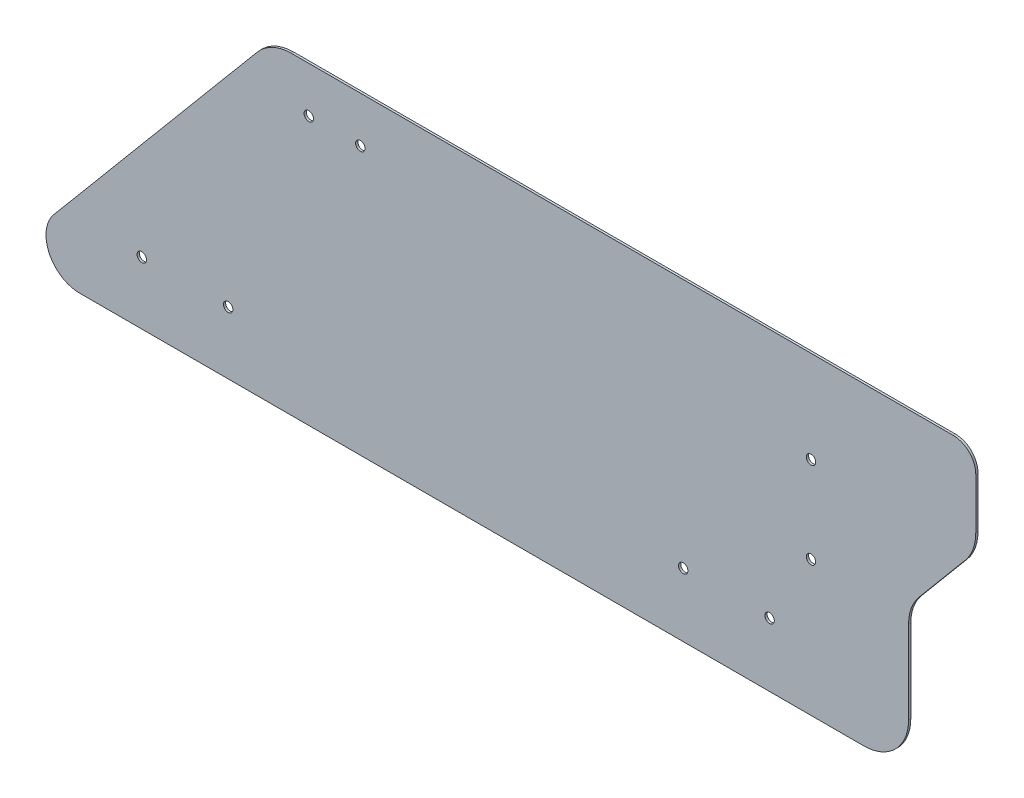
ISO-10303-21;
HEADER;
FILE_DESCRIPTION(('STEP AP214'),'2;1');
FILE_NAME('part.step','',(''),(''),'','','');
FILE_SCHEMA(('AUTOMOTIVE_DESIGN { 1 0 10303 214 1 1 1 1 }'));
ENDSEC;
DATA;
#1=APPLICATION_CONTEXT('core data for automotive mechanical design processes');
#2=APPLICATION_PROTOCOL_DEFINITION('international standard','automotive_design',2000,#1);
#3=PRODUCT_CONTEXT('',#1,'mechanical');
#4=PRODUCT('Part','Part','',(#3));
#5=PRODUCT_RELATED_PRODUCT_CATEGORY('part','',(#4));
#6=PRODUCT_DEFINITION_FORMATION('','',#4);
#7=PRODUCT_DEFINITION_CONTEXT('part definition',#1,'design');
#8=PRODUCT_DEFINITION('design','',#6,#7);
#9=PRODUCT_DEFINITION_SHAPE('','',#8);
#10=(LENGTH_UNIT() NAMED_UNIT(*) SI_UNIT(.MILLI.,.METRE.));
#11=(NAMED_UNIT(*) PLANE_ANGLE_UNIT() SI_UNIT($,.RADIAN.));
#12=(NAMED_UNIT(*) SI_UNIT($,.STERADIAN.) SOLID_ANGLE_UNIT());
#13=UNCERTAINTY_MEASURE_WITH_UNIT(LENGTH_MEASURE(1.E-05),#10,'distance_accuracy_value','');
#14=(GEOMETRIC_REPRESENTATION_CONTEXT(3) GLOBAL_UNCERTAINTY_ASSIGNED_CONTEXT((#13)) GLOBAL_UNIT_ASSIGNED_CONTEXT((#10,
#11,#12)) REPRESENTATION_CONTEXT('',''));
#15=CARTESIAN_POINT('',(0.,0.,0.));
#16=DIRECTION('',(0.,0.,1.));
#17=DIRECTION('',(1.,0.,0.));
#18=AXIS2_PLACEMENT_3D('',#15,#16,#17);
#19=CARTESIAN_POINT('',(190.,60.,-1.));
#20=DIRECTION('',(0.,0.,1.));
#21=DIRECTION('',(1.,0.,0.));
#22=AXIS2_PLACEMENT_3D('',#19,#20,#21);
#23=CYLINDRICAL_SURFACE('',#22,10.);
#24=CARTESIAN_POINT('',(190.,60.,0.));
#25=DIRECTION('',(0.,0.,1.));
#26=DIRECTION('',(-1.,0.,0.));
#27=AXIS2_PLACEMENT_3D('',#24,#25,#26);
#28=CIRCLE('',#27,10.);
#29=CARTESIAN_POINT('',(200.,60.,0.));
#30=VERTEX_POINT('',#29);
#31=CARTESIAN_POINT('',(190.,70.,0.));
#32=VERTEX_POINT('',#31);
#33=EDGE_CURVE('E160',#30,#32,#28,.T.);
#34=ORIENTED_EDGE('',*,*,#33,.F.);
#35=DIRECTION('',(0.,0.,1.));
#36=VECTOR('',#35,1.);
#37=CARTESIAN_POINT('',(200.,60.,-1.));
#38=LINE('',#37,#36);
#39=CARTESIAN_POINT('',(200.,60.,-1.));
#40=VERTEX_POINT('',#39);
#41=EDGE_CURVE('E11',#40,#30,#38,.T.);
#42=ORIENTED_EDGE('',*,*,#41,.F.);
#43=CARTESIAN_POINT('',(190.,60.,-1.));
#44=DIRECTION('',(0.,0.,1.));
#45=DIRECTION('',(-1.,0.,0.));
#46=AXIS2_PLACEMENT_3D('',#43,#44,#45);
#47=CIRCLE('',#46,10.);
#48=CARTESIAN_POINT('',(190.,70.,-1.));
#49=VERTEX_POINT('',#48);
#50=EDGE_CURVE('E193',#40,#49,#47,.T.);
#51=ORIENTED_EDGE('',*,*,#50,.T.);
#52=DIRECTION('',(0.,0.,1.));
#53=VECTOR('',#52,1.);
#54=CARTESIAN_POINT('',(190.,70.,-1.));
#55=LINE('',#54,#53);
#56=EDGE_CURVE('E106',#49,#32,#55,.T.);
#57=ORIENTED_EDGE('',*,*,#56,.T.);
#58=EDGE_LOOP('',(#34,#42,#51,#57));
#59=FACE_BOUND('',#58,.T.);
#60=ADVANCED_FACE('F38',(#59),#23,.T.);
#61=CARTESIAN_POINT('',(200.,37.2794046853241,-1.));
#62=DIRECTION('',(1.,0.,0.));
#63=DIRECTION('',(0.,1.,0.));
#64=AXIS2_PLACEMENT_3D('',#61,#62,#63);
#65=PLANE('',#64);
#66=DIRECTION('',(0.,1.,0.));
#67=VECTOR('',#66,1.);
#68=CARTESIAN_POINT('',(200.,37.2794046853241,0.));
#69=LINE('',#68,#67);
#70=CARTESIAN_POINT('',(200.,37.2794046853241,0.));
#71=VERTEX_POINT('',#70);
#72=EDGE_CURVE('E191',#71,#30,#69,.T.);
#73=ORIENTED_EDGE('',*,*,#72,.F.);
#74=DIRECTION('',(0.,0.,1.));
#75=VECTOR('',#74,1.);
#76=CARTESIAN_POINT('',(200.,37.2794046853241,-1.));
#77=LINE('',#76,#75);
#78=CARTESIAN_POINT('',(200.,37.2794046853241,-1.));
#79=VERTEX_POINT('',#78);
#80=EDGE_CURVE('E47',#79,#71,#77,.T.);
#81=ORIENTED_EDGE('',*,*,#80,.F.);
#82=DIRECTION('',(0.,1.,0.));
#83=VECTOR('',#82,1.);
#84=CARTESIAN_POINT('',(200.,37.2794046853241,-1.));
#85=LINE('',#84,#83);
#86=EDGE_CURVE('E150',#79,#40,#85,.T.);
#87=ORIENTED_EDGE('',*,*,#86,.T.);
#88=ORIENTED_EDGE('',*,*,#41,.T.);
#89=EDGE_LOOP('',(#73,#81,#87,#88));
#90=FACE_BOUND('',#89,.T.);
#91=ADVANCED_FACE('F301',(#90),#65,.T.);
#92=CARTESIAN_POINT('',(180.,37.2794046853241,-1.));
#93=DIRECTION('',(0.,0.,1.));
#94=DIRECTION('',(1.,0.,0.));
#95=AXIS2_PLACEMENT_3D('',#92,#93,#94);
#96=CYLINDRICAL_SURFACE('',#95,20.);
#97=CARTESIAN_POINT('',(180.,37.2794046853241,0.));
#98=DIRECTION('',(0.,0.,1.));
#99=DIRECTION('',(1.,0.,0.));
#100=AXIS2_PLACEMENT_3D('',#97,#98,#99);
#101=CIRCLE('',#100,20.);
#102=CARTESIAN_POINT('',(195.320888862379,24.4236524915933,0.));
#103=VERTEX_POINT('',#102);
#104=EDGE_CURVE('E137',#103,#71,#101,.T.);
#105=ORIENTED_EDGE('',*,*,#104,.F.);
#106=DIRECTION('',(0.,0.,1.));
#107=VECTOR('',#106,1.);
#108=CARTESIAN_POINT('',(195.320888862379,24.4236524915933,-1.));
#109=LINE('',#108,#107);
#110=CARTESIAN_POINT('',(195.320888862379,24.4236524915933,-1.));
#111=VERTEX_POINT('',#110);
#112=EDGE_CURVE('E132',#111,#103,#109,.T.);
#113=ORIENTED_EDGE('',*,*,#112,.F.);
#114=CARTESIAN_POINT('',(180.,37.2794046853241,-1.));
#115=DIRECTION('',(0.,0.,1.));
#116=DIRECTION('',(1.,0.,0.));
#117=AXIS2_PLACEMENT_3D('',#114,#115,#116);
#118=CIRCLE('',#117,20.);
#119=EDGE_CURVE('E135',#111,#79,#118,.T.);
#120=ORIENTED_EDGE('',*,*,#119,.T.);
#121=ORIENTED_EDGE('',*,*,#80,.T.);
#122=EDGE_LOOP('',(#105,#113,#120,#121));
#123=FACE_BOUND('',#122,.T.);
#124=ADVANCED_FACE('F134',(#123),#96,.T.);
#125=CARTESIAN_POINT('',(174.67911113762,-0.176260269419207,-1.));
#126=DIRECTION('',(0.766044443118975,-0.642787609686543,0.));
#127=DIRECTION('',(0.642787609686543,0.766044443118975,0.));
#128=AXIS2_PLACEMENT_3D('',#125,#126,#127);
#129=PLANE('',#128);
#130=DIRECTION('',(0.642787609686543,0.766044443118975,0.));
#131=VECTOR('',#130,1.);
#132=CARTESIAN_POINT('',(174.67911113762,-0.176260269419207,0.));
#133=LINE('',#132,#131);
#134=CARTESIAN_POINT('',(174.67911113762,-0.176260269419217,0.));
#135=VERTEX_POINT('',#134);
#136=EDGE_CURVE('E188',#135,#103,#133,.T.);
#137=ORIENTED_EDGE('',*,*,#136,.F.);
#138=DIRECTION('',(0.,0.,1.));
#139=VECTOR('',#138,1.);
#140=CARTESIAN_POINT('',(174.67911113762,-0.176260269419217,-1.));
#141=LINE('',#140,#139);
#142=CARTESIAN_POINT('',(174.67911113762,-0.176260269419217,-1.));
#143=VERTEX_POINT('',#142);
#144=EDGE_CURVE('E142',#143,#135,#141,.T.);
#145=ORIENTED_EDGE('',*,*,#144,.F.);
#146=DIRECTION('',(0.642787609686543,0.766044443118975,0.));
#147=VECTOR('',#146,1.);
#148=CARTESIAN_POINT('',(174.67911113762,-0.176260269419207,-1.));
#149=LINE('',#148,#147);
#150=EDGE_CURVE('E148',#143,#111,#149,.T.);
#151=ORIENTED_EDGE('',*,*,#150,.T.);
#152=ORIENTED_EDGE('',*,*,#112,.T.);
#153=EDGE_LOOP('',(#137,#145,#151,#152));
#154=FACE_BOUND('',#153,.T.);
#155=ADVANCED_FACE('F152',(#154),#129,.T.);
#156=CARTESIAN_POINT('',(190.,-13.0320124631501,-1.));
#157=DIRECTION('',(0.,0.,1.));
#158=DIRECTION('',(1.,0.,0.));
#159=AXIS2_PLACEMENT_3D('',#156,#157,#158);
#160=CYLINDRICAL_SURFACE('',#159,20.);
#161=CARTESIAN_POINT('',(190.,-13.0320124631501,0.));
#162=DIRECTION('',(0.,0.,-1.));
#163=DIRECTION('',(-1.,0.,0.));
#164=AXIS2_PLACEMENT_3D('',#161,#162,#163);
#165=CIRCLE('',#164,20.);
#166=CARTESIAN_POINT('',(170.,-13.0320124631501,0.));
#167=VERTEX_POINT('',#166);
#168=EDGE_CURVE('E185',#167,#135,#165,.T.);
#169=ORIENTED_EDGE('',*,*,#168,.F.);
#170=DIRECTION('',(0.,0.,1.));
#171=VECTOR('',#170,1.);
#172=CARTESIAN_POINT('',(170.,-13.0320124631501,-1.));
#173=LINE('',#172,#171);
#174=CARTESIAN_POINT('',(170.,-13.0320124631501,-1.));
#175=VERTEX_POINT('',#174);
#176=EDGE_CURVE('E197',#175,#167,#173,.T.);
#177=ORIENTED_EDGE('',*,*,#176,.F.);
#178=CARTESIAN_POINT('',(190.,-13.0320124631501,-1.));
#179=DIRECTION('',(0.,0.,-1.));
#180=DIRECTION('',(-1.,0.,0.));
#181=AXIS2_PLACEMENT_3D('',#178,#179,#180);
#182=CIRCLE('',#181,20.);
#183=EDGE_CURVE('E153',#175,#143,#182,.T.);
#184=ORIENTED_EDGE('',*,*,#183,.T.);
#185=ORIENTED_EDGE('',*,*,#144,.T.);
#186=EDGE_LOOP('',(#169,#177,#184,#185));
#187=FACE_BOUND('',#186,.T.);
#188=ADVANCED_FACE('F314',(#187),#160,.F.);
#189=CARTESIAN_POINT('',(170.,-50.,-1.));
#190=DIRECTION('',(1.,0.,0.));
#191=DIRECTION('',(0.,1.,0.));
#192=AXIS2_PLACEMENT_3D('',#189,#190,#191);
#193=PLANE('',#192);
#194=DIRECTION('',(0.,1.,0.));
#195=VECTOR('',#194,1.);
#196=CARTESIAN_POINT('',(170.,-50.,0.));
#197=LINE('',#196,#195);
#198=CARTESIAN_POINT('',(170.,-50.,0.));
#199=VERTEX_POINT('',#198);
#200=EDGE_CURVE('E182',#199,#167,#197,.T.);
#201=ORIENTED_EDGE('',*,*,#200,.F.);
#202=DIRECTION('',(0.,0.,1.));
#203=VECTOR('',#202,1.);
#204=CARTESIAN_POINT('',(170.,-50.,-1.));
#205=LINE('',#204,#203);
#206=CARTESIAN_POINT('',(170.,-50.,-1.));
#207=VERTEX_POINT('',#206);
#208=EDGE_CURVE('E199',#207,#199,#205,.T.);
#209=ORIENTED_EDGE('',*,*,#208,.F.);
#210=DIRECTION('',(0.,1.,0.));
#211=VECTOR('',#210,1.);
#212=CARTESIAN_POINT('',(170.,-50.,-1.));
#213=LINE('',#212,#211);
#214=EDGE_CURVE('E155',#207,#175,#213,.T.);
#215=ORIENTED_EDGE('',*,*,#214,.T.);
#216=ORIENTED_EDGE('',*,*,#176,.T.);
#217=EDGE_LOOP('',(#201,#209,#215,#216));
#218=FACE_BOUND('',#217,.T.);
#219=ADVANCED_FACE('F276',(#218),#193,.T.);
#220=CARTESIAN_POINT('',(150.,-50.,-1.));
#221=DIRECTION('',(0.,0.,1.));
#222=DIRECTION('',(1.,0.,0.));
#223=AXIS2_PLACEMENT_3D('',#220,#221,#222);
#224=CYLINDRICAL_SURFACE('',#223,20.);
#225=CARTESIAN_POINT('',(150.,-50.,0.));
#226=DIRECTION('',(0.,0.,1.));
#227=DIRECTION('',(1.,0.,0.));
#228=AXIS2_PLACEMENT_3D('',#225,#226,#227);
#229=CIRCLE('',#228,20.);
#230=CARTESIAN_POINT('',(150.,-70.,0.));
#231=VERTEX_POINT('',#230);
#232=EDGE_CURVE('E179',#231,#199,#229,.T.);
#233=ORIENTED_EDGE('',*,*,#232,.F.);
#234=DIRECTION('',(0.,0.,1.));
#235=VECTOR('',#234,1.);
#236=CARTESIAN_POINT('',(150.,-70.,-1.));
#237=LINE('',#236,#235);
#238=CARTESIAN_POINT('',(150.,-70.,-1.));
#239=VERTEX_POINT('',#238);
#240=EDGE_CURVE('E201',#239,#231,#237,.T.);
#241=ORIENTED_EDGE('',*,*,#240,.F.);
#242=CARTESIAN_POINT('',(150.,-50.,-1.));
#243=DIRECTION('',(0.,0.,1.));
#244=DIRECTION('',(1.,0.,0.));
#245=AXIS2_PLACEMENT_3D('',#242,#243,#244);
#246=CIRCLE('',#245,20.);
#247=EDGE_CURVE('E270',#239,#207,#246,.T.);
#248=ORIENTED_EDGE('',*,*,#247,.T.);
#249=ORIENTED_EDGE('',*,*,#208,.T.);
#250=EDGE_LOOP('',(#233,#241,#248,#249));
#251=FACE_BOUND('',#250,.T.);
#252=ADVANCED_FACE('F282',(#251),#224,.T.);
#253=CARTESIAN_POINT('',(-200.,-70.,-1.));
#254=DIRECTION('',(0.,-1.,0.));
#255=DIRECTION('',(1.,0.,0.));
#256=AXIS2_PLACEMENT_3D('',#253,#254,#255);
#257=PLANE('',#256);
#258=DIRECTION('',(1.,0.,0.));
#259=VECTOR('',#258,1.);
#260=CARTESIAN_POINT('',(-200.,-70.,0.));
#261=LINE('',#260,#259);
#262=CARTESIAN_POINT('',(-200.,-70.,0.));
#263=VERTEX_POINT('',#262);
#264=EDGE_CURVE('E176',#263,#231,#261,.T.);
#265=ORIENTED_EDGE('',*,*,#264,.F.);
#266=DIRECTION('',(0.,0.,1.));
#267=VECTOR('',#266,1.);
#268=CARTESIAN_POINT('',(-200.,-70.,-1.));
#269=LINE('',#268,#267);
#270=CARTESIAN_POINT('',(-200.,-70.,-1.));
#271=VERTEX_POINT('',#270);
#272=EDGE_CURVE('E203',#271,#263,#269,.T.);
#273=ORIENTED_EDGE('',*,*,#272,.F.);
#274=DIRECTION('',(1.,0.,0.));
#275=VECTOR('',#274,1.);
#276=CARTESIAN_POINT('',(-200.,-70.,-1.));
#277=LINE('',#276,#275);
#278=EDGE_CURVE('E267',#271,#239,#277,.T.);
#279=ORIENTED_EDGE('',*,*,#278,.T.);
#280=ORIENTED_EDGE('',*,*,#240,.T.);
#281=EDGE_LOOP('',(#265,#273,#279,#280));
#282=FACE_BOUND('',#281,.T.);
#283=ADVANCED_FACE('F285',(#282),#257,.T.);
#284=CARTESIAN_POINT('',(-200.,-55.,-1.));
#285=DIRECTION('',(0.,0.,1.));
#286=DIRECTION('',(1.,0.,0.));
#287=AXIS2_PLACEMENT_3D('',#284,#285,#286);
#288=CYLINDRICAL_SURFACE('',#287,15.);
#289=CARTESIAN_POINT('',(-200.,-55.,0.));
#290=DIRECTION('',(0.,0.,1.));
#291=DIRECTION('',(1.,0.,0.));
#292=AXIS2_PLACEMENT_3D('',#289,#290,#291);
#293=CIRCLE('',#292,15.);
#294=CARTESIAN_POINT('',(-211.490666646785,-45.3581858547019,0.));
#295=VERTEX_POINT('',#294);
#296=EDGE_CURVE('E173',#295,#263,#293,.T.);
#297=ORIENTED_EDGE('',*,*,#296,.F.);
#298=DIRECTION('',(0.,0.,1.));
#299=VECTOR('',#298,1.);
#300=CARTESIAN_POINT('',(-211.490666646785,-45.3581858547019,-1.));
#301=LINE('',#300,#299);
#302=CARTESIAN_POINT('',(-211.490666646785,-45.3581858547019,-1.));
#303=VERTEX_POINT('',#302);
#304=EDGE_CURVE('E205',#303,#295,#301,.T.);
#305=ORIENTED_EDGE('',*,*,#304,.F.);
#306=CARTESIAN_POINT('',(-200.,-55.,-1.));
#307=DIRECTION('',(0.,0.,1.));
#308=DIRECTION('',(1.,0.,0.));
#309=AXIS2_PLACEMENT_3D('',#306,#307,#308);
#310=CIRCLE('',#309,15.);
#311=EDGE_CURVE('E264',#303,#271,#310,.T.);
#312=ORIENTED_EDGE('',*,*,#311,.T.);
#313=ORIENTED_EDGE('',*,*,#272,.T.);
#314=EDGE_LOOP('',(#297,#305,#312,#313));
#315=FACE_BOUND('',#314,.T.);
#316=ADVANCED_FACE('F290',(#315),#288,.T.);
#317=CARTESIAN_POINT('',(-120.688391142103,62.8557521937309,-1.));
#318=DIRECTION('',(-0.766044443118975,0.642787609686543,0.));
#319=DIRECTION('',(-0.642787609686543,-0.766044443118975,0.));
#320=AXIS2_PLACEMENT_3D('',#317,#318,#319);
#321=PLANE('',#320);
#322=DIRECTION('',(-0.642787609686543,-0.766044443118975,0.));
#323=VECTOR('',#322,1.);
#324=CARTESIAN_POINT('',(-120.688391142103,62.8557521937309,0.));
#325=LINE('',#324,#323);
#326=CARTESIAN_POINT('',(-120.688391142103,62.8557521937309,0.));
#327=VERTEX_POINT('',#326);
#328=EDGE_CURVE('E170',#327,#295,#325,.T.);
#329=ORIENTED_EDGE('',*,*,#328,.F.);
#330=DIRECTION('',(0.,0.,1.));
#331=VECTOR('',#330,1.);
#332=CARTESIAN_POINT('',(-120.688391142103,62.8557521937309,-1.));
#333=LINE('',#332,#331);
#334=CARTESIAN_POINT('',(-120.688391142103,62.8557521937309,-1.));
#335=VERTEX_POINT('',#334);
#336=EDGE_CURVE('E207',#335,#327,#333,.T.);
#337=ORIENTED_EDGE('',*,*,#336,.F.);
#338=DIRECTION('',(-0.642787609686543,-0.766044443118975,0.));
#339=VECTOR('',#338,1.);
#340=CARTESIAN_POINT('',(-120.688391142103,62.8557521937309,-1.));
#341=LINE('',#340,#339);
#342=EDGE_CURVE('E261',#335,#303,#341,.T.);
#343=ORIENTED_EDGE('',*,*,#342,.T.);
#344=ORIENTED_EDGE('',*,*,#304,.T.);
#345=EDGE_LOOP('',(#329,#337,#343,#344));
#346=FACE_BOUND('',#345,.T.);
#347=ADVANCED_FACE('F293',(#346),#321,.T.);
#348=CARTESIAN_POINT('',(-105.367502279723,50.,-1.));
#349=DIRECTION('',(0.,0.,1.));
#350=DIRECTION('',(1.,0.,0.));
#351=AXIS2_PLACEMENT_3D('',#348,#349,#350);
#352=CYLINDRICAL_SURFACE('',#351,20.);
#353=CARTESIAN_POINT('',(-105.367502279723,50.,0.));
#354=DIRECTION('',(0.,0.,1.));
#355=DIRECTION('',(-1.,0.,0.));
#356=AXIS2_PLACEMENT_3D('',#353,#354,#355);
#357=CIRCLE('',#356,20.);
#358=CARTESIAN_POINT('',(-105.367502279723,70.,0.));
#359=VERTEX_POINT('',#358);
#360=EDGE_CURVE('E167',#359,#327,#357,.T.);
#361=ORIENTED_EDGE('',*,*,#360,.F.);
#362=DIRECTION('',(0.,0.,1.));
#363=VECTOR('',#362,1.);
#364=CARTESIAN_POINT('',(-105.367502279723,70.,-1.));
#365=LINE('',#364,#363);
#366=CARTESIAN_POINT('',(-105.367502279723,70.,-1.));
#367=VERTEX_POINT('',#366);
#368=EDGE_CURVE('E209',#367,#359,#365,.T.);
#369=ORIENTED_EDGE('',*,*,#368,.F.);
#370=CARTESIAN_POINT('',(-105.367502279723,50.,-1.));
#371=DIRECTION('',(0.,0.,1.));
#372=DIRECTION('',(-1.,0.,0.));
#373=AXIS2_PLACEMENT_3D('',#370,#371,#372);
#374=CIRCLE('',#373,20.);
#375=EDGE_CURVE('E258',#367,#335,#374,.T.);
#376=ORIENTED_EDGE('',*,*,#375,.T.);
#377=ORIENTED_EDGE('',*,*,#336,.T.);
#378=EDGE_LOOP('',(#361,#369,#376,#377));
#379=FACE_BOUND('',#378,.T.);
#380=ADVANCED_FACE('F297',(#379),#352,.T.);
#381=CARTESIAN_POINT('',(-105.367502279723,70.,-1.));
#382=DIRECTION('',(0.,1.,0.));
#383=DIRECTION('',(-1.,0.,0.));
#384=AXIS2_PLACEMENT_3D('',#381,#382,#383);
#385=PLANE('',#384);
#386=DIRECTION('',(-1.,0.,0.));
#387=VECTOR('',#386,1.);
#388=CARTESIAN_POINT('',(-105.367502279723,70.,0.));
#389=LINE('',#388,#387);
#390=EDGE_CURVE('E163',#32,#359,#389,.T.);
#391=ORIENTED_EDGE('',*,*,#390,.F.);
#392=ORIENTED_EDGE('',*,*,#56,.F.);
#393=DIRECTION('',(-1.,0.,0.));
#394=VECTOR('',#393,1.);
#395=CARTESIAN_POINT('',(-105.367502279723,70.,-1.));
#396=LINE('',#395,#394);
#397=EDGE_CURVE('E256',#49,#367,#396,.T.);
#398=ORIENTED_EDGE('',*,*,#397,.T.);
#399=ORIENTED_EDGE('',*,*,#368,.T.);
#400=EDGE_LOOP('',(#391,#392,#398,#399));
#401=FACE_BOUND('',#400,.T.);
#402=ADVANCED_FACE('F298',(#401),#385,.T.);
#403=CARTESIAN_POINT('',(190.,60.,-1.));
#404=DIRECTION('',(0.,0.,-1.));
#405=DIRECTION('',(-1.,0.,0.));
#406=AXIS2_PLACEMENT_3D('',#403,#404,#405);
#407=PLANE('',#406);
#408=CARTESIAN_POINT('',(126.465961360019,28.9105954547135,-1.));
#409=DIRECTION('',(0.,0.,-1.));
#410=DIRECTION('',(-1.,0.,0.));
#411=AXIS2_PLACEMENT_3D('',#408,#409,#410);
#412=CIRCLE('',#411,2.09999999999999);
#413=CARTESIAN_POINT('',(124.365961360019,28.9105954547135,-1.));
#414=VERTEX_POINT('',#413);
#415=EDGE_CURVE('E375',#414,#414,#412,.T.);
#416=ORIENTED_EDGE('',*,*,#415,.F.);
#417=EDGE_LOOP('',(#416));
#418=FACE_BOUND('',#417,.T.);
#419=CARTESIAN_POINT('',(-97.693405311377,49.5967679591198,-1.));
#420=DIRECTION('',(0.,0.,-1.));
#421=DIRECTION('',(-1.,0.,0.));
#422=AXIS2_PLACEMENT_3D('',#419,#420,#421);
#423=CIRCLE('',#422,2.1);
#424=CARTESIAN_POINT('',(-99.7934053113771,49.5967679591198,-1.));
#425=VERTEX_POINT('',#424);
#426=EDGE_CURVE('E234',#425,#425,#423,.T.);
#427=ORIENTED_EDGE('',*,*,#426,.F.);
#428=EDGE_LOOP('',(#427));
#429=FACE_BOUND('',#428,.T.);
#430=CARTESIAN_POINT('',(126.465961360019,-9.64433534019099,-1.));
#431=DIRECTION('',(0.,0.,-1.));
#432=DIRECTION('',(-1.,0.,0.));
#433=AXIS2_PLACEMENT_3D('',#430,#431,#432);
#434=CIRCLE('',#433,2.09999999999999);
#435=CARTESIAN_POINT('',(124.365961360019,-9.64433534019099,-1.));
#436=VERTEX_POINT('',#435);
#437=EDGE_CURVE('E223',#436,#436,#434,.T.);
#438=ORIENTED_EDGE('',*,*,#437,.F.);
#439=EDGE_LOOP('',(#438));
#440=FACE_BOUND('',#439,.T.);
#441=CARTESIAN_POINT('',(-74.6982740879426,49.5967679591198,-1.));
#442=DIRECTION('',(0.,0.,-1.));
#443=DIRECTION('',(-1.,0.,0.));
#444=AXIS2_PLACEMENT_3D('',#441,#442,#443);
#445=CIRCLE('',#444,2.1);
#446=CARTESIAN_POINT('',(-76.7982740879426,49.5967679591198,-1.));
#447=VERTEX_POINT('',#446);
#448=EDGE_CURVE('E220',#447,#447,#445,.T.);
#449=ORIENTED_EDGE('',*,*,#448,.F.);
#450=EDGE_LOOP('',(#449));
#451=FACE_BOUND('',#450,.T.);
#452=CARTESIAN_POINT('',(-172.245776601783,-42.192339033667,-1.00000000000006));
#453=DIRECTION('',(0.,0.,-1.));
#454=DIRECTION('',(-1.,0.,0.));
#455=AXIS2_PLACEMENT_3D('',#452,#453,#454);
#456=CIRCLE('',#455,2.09999999999999);
#457=CARTESIAN_POINT('',(-174.345776601783,-42.192339033667,-1.00000000000006));
#458=VERTEX_POINT('',#457);
#459=EDGE_CURVE('E219',#458,#458,#456,.T.);
#460=ORIENTED_EDGE('',*,*,#459,.F.);
#461=EDGE_LOOP('',(#460));
#462=FACE_BOUND('',#461,.T.);
#463=CARTESIAN_POINT('',(-133.690845806878,-42.1923390336673,-1.));
#464=DIRECTION('',(0.,0.,-1.));
#465=DIRECTION('',(-1.,0.,0.));
#466=AXIS2_PLACEMENT_3D('',#463,#464,#465);
#467=CIRCLE('',#466,2.09999999999999);
#468=CARTESIAN_POINT('',(-135.790845806878,-42.1923390336673,-1.));
#469=VERTEX_POINT('',#468);
#470=EDGE_CURVE('E243',#469,#469,#467,.T.);
#471=ORIENTED_EDGE('',*,*,#470,.F.);
#472=EDGE_LOOP('',(#471));
#473=FACE_BOUND('',#472,.T.);
#474=CARTESIAN_POINT('',(69.4216260198245,-41.5999999999987,-1.));
#475=DIRECTION('',(0.,0.,-1.));
#476=DIRECTION('',(-1.,0.,0.));
#477=AXIS2_PLACEMENT_3D('',#474,#475,#476);
#478=CIRCLE('',#477,2.1);
#479=CARTESIAN_POINT('',(67.3216260198245,-41.5999999999987,-1.));
#480=VERTEX_POINT('',#479);
#481=EDGE_CURVE('E216',#480,#480,#478,.T.);
#482=ORIENTED_EDGE('',*,*,#481,.F.);
#483=EDGE_LOOP('',(#482));
#484=FACE_BOUND('',#483,.T.);
#485=CARTESIAN_POINT('',(107.976556814729,-41.5999999999985,-1.));
#486=DIRECTION('',(0.,0.,-1.));
#487=DIRECTION('',(-1.,0.,0.));
#488=AXIS2_PLACEMENT_3D('',#485,#486,#487);
#489=CIRCLE('',#488,2.1);
#490=CARTESIAN_POINT('',(105.876556814729,-41.5999999999985,-1.));
#491=VERTEX_POINT('',#490);
#492=EDGE_CURVE('E215',#491,#491,#489,.T.);
#493=ORIENTED_EDGE('',*,*,#492,.F.);
#494=EDGE_LOOP('',(#493));
#495=FACE_BOUND('',#494,.T.);
#496=ORIENTED_EDGE('',*,*,#50,.F.);
#497=ORIENTED_EDGE('',*,*,#86,.F.);
#498=ORIENTED_EDGE('',*,*,#119,.F.);
#499=ORIENTED_EDGE('',*,*,#150,.F.);
#500=ORIENTED_EDGE('',*,*,#183,.F.);
#501=ORIENTED_EDGE('',*,*,#214,.F.);
#502=ORIENTED_EDGE('',*,*,#247,.F.);
#503=ORIENTED_EDGE('',*,*,#278,.F.);
#504=ORIENTED_EDGE('',*,*,#311,.F.);
#505=ORIENTED_EDGE('',*,*,#342,.F.);
#506=ORIENTED_EDGE('',*,*,#375,.F.);
#507=ORIENTED_EDGE('',*,*,#397,.F.);
#508=EDGE_LOOP('',(#496,#497,#498,#499,#500,#501,#502,#503,#504,#505,#506,#507));
#509=FACE_BOUND('',#508,.T.);
#510=ADVANCED_FACE('F146',(#418,#429,#440,#451,#462,#473,#484,#495,#509),#407,.T.);
#511=CARTESIAN_POINT('',(190.,60.,0.));
#512=DIRECTION('',(0.,0.,-1.));
#513=DIRECTION('',(-1.,0.,0.));
#514=AXIS2_PLACEMENT_3D('',#511,#512,#513);
#515=PLANE('',#514);
#516=CARTESIAN_POINT('',(126.465961360019,28.9105954547135,0.));
#517=DIRECTION('',(0.,0.,-1.));
#518=DIRECTION('',(-1.,0.,0.));
#519=AXIS2_PLACEMENT_3D('',#516,#517,#518);
#520=CIRCLE('',#519,2.09999999999999);
#521=CARTESIAN_POINT('',(124.365961360019,28.9105954547135,0.));
#522=VERTEX_POINT('',#521);
#523=EDGE_CURVE('E41',#522,#522,#520,.T.);
#524=ORIENTED_EDGE('',*,*,#523,.T.);
#525=EDGE_LOOP('',(#524));
#526=FACE_BOUND('',#525,.T.);
#527=CARTESIAN_POINT('',(-97.693405311377,49.5967679591198,0.));
#528=DIRECTION('',(0.,0.,-1.));
#529=DIRECTION('',(-1.,0.,0.));
#530=AXIS2_PLACEMENT_3D('',#527,#528,#529);
#531=CIRCLE('',#530,2.1);
#532=CARTESIAN_POINT('',(-99.7934053113771,49.5967679591198,0.));
#533=VERTEX_POINT('',#532);
#534=EDGE_CURVE('E229',#533,#533,#531,.T.);
#535=ORIENTED_EDGE('',*,*,#534,.T.);
#536=EDGE_LOOP('',(#535));
#537=FACE_BOUND('',#536,.T.);
#538=CARTESIAN_POINT('',(126.465961360019,-9.64433534019099,0.));
#539=DIRECTION('',(0.,0.,-1.));
#540=DIRECTION('',(-1.,0.,0.));
#541=AXIS2_PLACEMENT_3D('',#538,#539,#540);
#542=CIRCLE('',#541,2.09999999999999);
#543=CARTESIAN_POINT('',(124.365961360019,-9.64433534019099,0.));
#544=VERTEX_POINT('',#543);
#545=EDGE_CURVE('E221',#544,#544,#542,.T.);
#546=ORIENTED_EDGE('',*,*,#545,.T.);
#547=EDGE_LOOP('',(#546));
#548=FACE_BOUND('',#547,.T.);
#549=CARTESIAN_POINT('',(-74.6982740879426,49.5967679591198,0.));
#550=DIRECTION('',(0.,0.,-1.));
#551=DIRECTION('',(-1.,0.,0.));
#552=AXIS2_PLACEMENT_3D('',#549,#550,#551);
#553=CIRCLE('',#552,2.1);
#554=CARTESIAN_POINT('',(-76.7982740879426,49.5967679591198,0.));
#555=VERTEX_POINT('',#554);
#556=EDGE_CURVE('E217',#555,#555,#553,.T.);
#557=ORIENTED_EDGE('',*,*,#556,.T.);
#558=EDGE_LOOP('',(#557));
#559=FACE_BOUND('',#558,.T.);
#560=CARTESIAN_POINT('',(-172.245776601783,-42.192339033667,0.));
#561=DIRECTION('',(0.,0.,-1.));
#562=DIRECTION('',(-1.,0.,0.));
#563=AXIS2_PLACEMENT_3D('',#560,#561,#562);
#564=CIRCLE('',#563,2.09999999999999);
#565=CARTESIAN_POINT('',(-174.345776601783,-42.192339033667,0.));
#566=VERTEX_POINT('',#565);
#567=EDGE_CURVE('E240',#566,#566,#564,.T.);
#568=ORIENTED_EDGE('',*,*,#567,.T.);
#569=EDGE_LOOP('',(#568));
#570=FACE_BOUND('',#569,.T.);
#571=CARTESIAN_POINT('',(-133.690845806878,-42.1923390336673,0.));
#572=DIRECTION('',(0.,0.,-1.));
#573=DIRECTION('',(-1.,0.,0.));
#574=AXIS2_PLACEMENT_3D('',#571,#572,#573);
#575=CIRCLE('',#574,2.09999999999999);
#576=CARTESIAN_POINT('',(-135.790845806878,-42.1923390336673,0.));
#577=VERTEX_POINT('',#576);
#578=EDGE_CURVE('E246',#577,#577,#575,.T.);
#579=ORIENTED_EDGE('',*,*,#578,.T.);
#580=EDGE_LOOP('',(#579));
#581=FACE_BOUND('',#580,.T.);
#582=CARTESIAN_POINT('',(69.4216260198245,-41.5999999999987,0.));
#583=DIRECTION('',(0.,0.,-1.));
#584=DIRECTION('',(-1.,0.,0.));
#585=AXIS2_PLACEMENT_3D('',#582,#583,#584);
#586=CIRCLE('',#585,2.1);
#587=CARTESIAN_POINT('',(67.3216260198245,-41.5999999999987,0.));
#588=VERTEX_POINT('',#587);
#589=EDGE_CURVE('E212',#588,#588,#586,.T.);
#590=ORIENTED_EDGE('',*,*,#589,.T.);
#591=EDGE_LOOP('',(#590));
#592=FACE_BOUND('',#591,.T.);
#593=CARTESIAN_POINT('',(107.976556814729,-41.5999999999985,0.));
#594=DIRECTION('',(0.,0.,-1.));
#595=DIRECTION('',(-1.,0.,0.));
#596=AXIS2_PLACEMENT_3D('',#593,#594,#595);
#597=CIRCLE('',#596,2.1);
#598=CARTESIAN_POINT('',(105.876556814729,-41.5999999999985,0.));
#599=VERTEX_POINT('',#598);
#600=EDGE_CURVE('E164',#599,#599,#597,.T.);
#601=ORIENTED_EDGE('',*,*,#600,.T.);
#602=EDGE_LOOP('',(#601));
#603=FACE_BOUND('',#602,.T.);
#604=ORIENTED_EDGE('',*,*,#33,.T.);
#605=ORIENTED_EDGE('',*,*,#390,.T.);
#606=ORIENTED_EDGE('',*,*,#360,.T.);
#607=ORIENTED_EDGE('',*,*,#328,.T.);
#608=ORIENTED_EDGE('',*,*,#296,.T.);
#609=ORIENTED_EDGE('',*,*,#264,.T.);
#610=ORIENTED_EDGE('',*,*,#232,.T.);
#611=ORIENTED_EDGE('',*,*,#200,.T.);
#612=ORIENTED_EDGE('',*,*,#168,.T.);
#613=ORIENTED_EDGE('',*,*,#136,.T.);
#614=ORIENTED_EDGE('',*,*,#104,.T.);
#615=ORIENTED_EDGE('',*,*,#72,.T.);
#616=EDGE_LOOP('',(#604,#605,#606,#607,#608,#609,#610,#611,#612,#613,#614,#615));
#617=FACE_BOUND('',#616,.T.);
#618=ADVANCED_FACE('F300',(#526,#537,#548,#559,#570,#581,#592,#603,#617),#515,.F.);
#619=CARTESIAN_POINT('',(107.976556814729,-41.5999999999985,-1.));
#620=DIRECTION('',(0.,0.,-1.));
#621=DIRECTION('',(-1.,0.,0.));
#622=AXIS2_PLACEMENT_3D('',#619,#620,#621);
#623=CYLINDRICAL_SURFACE('',#622,2.1);
#624=ORIENTED_EDGE('',*,*,#492,.T.);
#625=EDGE_LOOP('',(#624));
#626=FACE_BOUND('',#625,.T.);
#627=ORIENTED_EDGE('',*,*,#600,.F.);
#628=EDGE_LOOP('',(#627));
#629=FACE_BOUND('',#628,.T.);
#630=ADVANCED_FACE('F337',(#626,#629),#623,.F.);
#631=CARTESIAN_POINT('',(69.4216260198245,-41.5999999999987,-1.));
#632=DIRECTION('',(0.,0.,-1.));
#633=DIRECTION('',(-1.,0.,0.));
#634=AXIS2_PLACEMENT_3D('',#631,#632,#633);
#635=CYLINDRICAL_SURFACE('',#634,2.1);
#636=ORIENTED_EDGE('',*,*,#481,.T.);
#637=EDGE_LOOP('',(#636));
#638=FACE_BOUND('',#637,.T.);
#639=ORIENTED_EDGE('',*,*,#589,.F.);
#640=EDGE_LOOP('',(#639));
#641=FACE_BOUND('',#640,.T.);
#642=ADVANCED_FACE('F344',(#638,#641),#635,.F.);
#643=CARTESIAN_POINT('',(-133.690845806878,-42.1923390336673,-1.));
#644=DIRECTION('',(0.,0.,-1.));
#645=DIRECTION('',(-1.,0.,0.));
#646=AXIS2_PLACEMENT_3D('',#643,#644,#645);
#647=CYLINDRICAL_SURFACE('',#646,2.09999999999999);
#648=ORIENTED_EDGE('',*,*,#470,.T.);
#649=EDGE_LOOP('',(#648));
#650=FACE_BOUND('',#649,.T.);
#651=ORIENTED_EDGE('',*,*,#578,.F.);
#652=EDGE_LOOP('',(#651));
#653=FACE_BOUND('',#652,.T.);
#654=ADVANCED_FACE('F348',(#650,#653),#647,.F.);
#655=CARTESIAN_POINT('',(-172.245776601783,-42.192339033667,-1.00000000000006));
#656=DIRECTION('',(0.,0.,-1.));
#657=DIRECTION('',(-1.,0.,0.));
#658=AXIS2_PLACEMENT_3D('',#655,#656,#657);
#659=CYLINDRICAL_SURFACE('',#658,2.09999999999999);
#660=ORIENTED_EDGE('',*,*,#459,.T.);
#661=EDGE_LOOP('',(#660));
#662=FACE_BOUND('',#661,.T.);
#663=ORIENTED_EDGE('',*,*,#567,.F.);
#664=EDGE_LOOP('',(#663));
#665=FACE_BOUND('',#664,.T.);
#666=ADVANCED_FACE('F352',(#662,#665),#659,.F.);
#667=CARTESIAN_POINT('',(-74.6982740879426,49.5967679591198,-1.));
#668=DIRECTION('',(0.,0.,-1.));
#669=DIRECTION('',(-1.,0.,0.));
#670=AXIS2_PLACEMENT_3D('',#667,#668,#669);
#671=CYLINDRICAL_SURFACE('',#670,2.1);
#672=ORIENTED_EDGE('',*,*,#448,.T.);
#673=EDGE_LOOP('',(#672));
#674=FACE_BOUND('',#673,.T.);
#675=ORIENTED_EDGE('',*,*,#556,.F.);
#676=EDGE_LOOP('',(#675));
#677=FACE_BOUND('',#676,.T.);
#678=ADVANCED_FACE('F356',(#674,#677),#671,.F.);
#679=CARTESIAN_POINT('',(126.465961360019,-9.64433534019099,-1.));
#680=DIRECTION('',(0.,0.,-1.));
#681=DIRECTION('',(-1.,0.,0.));
#682=AXIS2_PLACEMENT_3D('',#679,#680,#681);
#683=CYLINDRICAL_SURFACE('',#682,2.09999999999999);
#684=ORIENTED_EDGE('',*,*,#437,.T.);
#685=EDGE_LOOP('',(#684));
#686=FACE_BOUND('',#685,.T.);
#687=ORIENTED_EDGE('',*,*,#545,.F.);
#688=EDGE_LOOP('',(#687));
#689=FACE_BOUND('',#688,.T.);
#690=ADVANCED_FACE('F360',(#686,#689),#683,.F.);
#691=CARTESIAN_POINT('',(-97.693405311377,49.5967679591198,-1.));
#692=DIRECTION('',(0.,0.,-1.));
#693=DIRECTION('',(-1.,0.,0.));
#694=AXIS2_PLACEMENT_3D('',#691,#692,#693);
#695=CYLINDRICAL_SURFACE('',#694,2.1);
#696=ORIENTED_EDGE('',*,*,#426,.T.);
#697=EDGE_LOOP('',(#696));
#698=FACE_BOUND('',#697,.T.);
#699=ORIENTED_EDGE('',*,*,#534,.F.);
#700=EDGE_LOOP('',(#699));
#701=FACE_BOUND('',#700,.T.);
#702=ADVANCED_FACE('F364',(#698,#701),#695,.F.);
#703=CARTESIAN_POINT('',(126.465961360019,28.9105954547135,-1.));
#704=DIRECTION('',(0.,0.,-1.));
#705=DIRECTION('',(-1.,0.,0.));
#706=AXIS2_PLACEMENT_3D('',#703,#704,#705);
#707=CYLINDRICAL_SURFACE('',#706,2.09999999999999);
#708=ORIENTED_EDGE('',*,*,#415,.T.);
#709=EDGE_LOOP('',(#708));
#710=FACE_BOUND('',#709,.T.);
#711=ORIENTED_EDGE('',*,*,#523,.F.);
#712=EDGE_LOOP('',(#711));
#713=FACE_BOUND('',#712,.T.);
#714=ADVANCED_FACE('F367',(#710,#713),#707,.F.);
#715=CLOSED_SHELL('',(#60,#91,#124,#155,#188,#219,#252,#283,#316,#347,#380,#402,#510,#618,#630,
#642,#654,#666,#678,#690,#702,#714));
#716=MANIFOLD_SOLID_BREP('B2',#715);
#717=ADVANCED_BREP_SHAPE_REPRESENTATION('',(#18,#716),#14);
#718=SHAPE_DEFINITION_REPRESENTATION(#9,#717);
ENDSEC;
END-ISO-10303-21;
